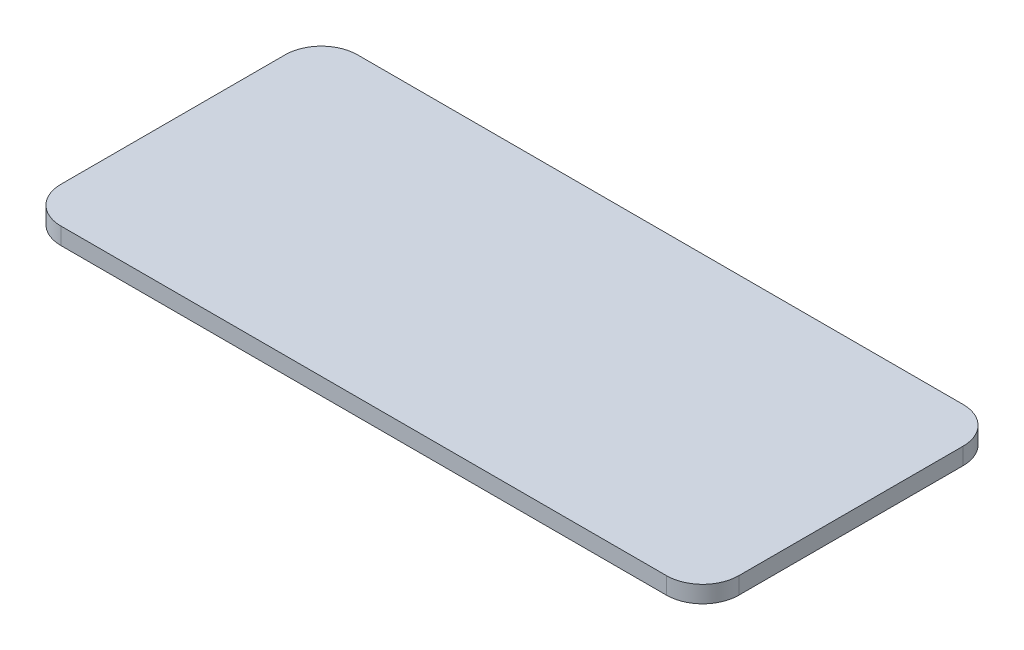
ISO-10303-21;
HEADER;
FILE_DESCRIPTION(('STEP AP214'),'2;1');
FILE_NAME('part.step','',(''),(''),'','','');
FILE_SCHEMA(('AUTOMOTIVE_DESIGN { 1 0 10303 214 1 1 1 1 }'));
ENDSEC;
DATA;
#1=APPLICATION_CONTEXT('core data for automotive mechanical design processes');
#2=APPLICATION_PROTOCOL_DEFINITION('international standard','automotive_design',2000,#1);
#3=PRODUCT_CONTEXT('',#1,'mechanical');
#4=PRODUCT('Part','Part','',(#3));
#5=PRODUCT_RELATED_PRODUCT_CATEGORY('part','',(#4));
#6=PRODUCT_DEFINITION_FORMATION('','',#4);
#7=PRODUCT_DEFINITION_CONTEXT('part definition',#1,'design');
#8=PRODUCT_DEFINITION('design','',#6,#7);
#9=PRODUCT_DEFINITION_SHAPE('','',#8);
#10=(LENGTH_UNIT() NAMED_UNIT(*) SI_UNIT(.MILLI.,.METRE.));
#11=(NAMED_UNIT(*) PLANE_ANGLE_UNIT() SI_UNIT($,.RADIAN.));
#12=(NAMED_UNIT(*) SI_UNIT($,.STERADIAN.) SOLID_ANGLE_UNIT());
#13=UNCERTAINTY_MEASURE_WITH_UNIT(LENGTH_MEASURE(1.E-05),#10,'distance_accuracy_value','');
#14=(GEOMETRIC_REPRESENTATION_CONTEXT(3) GLOBAL_UNCERTAINTY_ASSIGNED_CONTEXT((#13)) GLOBAL_UNIT_ASSIGNED_CONTEXT((#10,
#11,#12)) REPRESENTATION_CONTEXT('',''));
#15=CARTESIAN_POINT('',(0.,0.,0.));
#16=DIRECTION('',(0.,0.,1.));
#17=DIRECTION('',(1.,0.,0.));
#18=AXIS2_PLACEMENT_3D('',#15,#16,#17);
#19=CARTESIAN_POINT('',(-32.,1.59999999999999,-14.));
#20=DIRECTION('',(1.,0.,0.));
#21=DIRECTION('',(0.,0.,-1.));
#22=AXIS2_PLACEMENT_3D('',#19,#20,#21);
#23=PLANE('',#22);
#24=DIRECTION('',(0.,0.,1.));
#25=VECTOR('',#24,1.);
#26=CARTESIAN_POINT('',(-32.,1.59999999999999,-14.));
#27=LINE('',#26,#25);
#28=CARTESIAN_POINT('',(-32.,1.59999999999999,-10.59));
#29=VERTEX_POINT('',#28);
#30=CARTESIAN_POINT('',(-32.,1.59999999999999,10.59));
#31=VERTEX_POINT('',#30);
#32=EDGE_CURVE('E126',#29,#31,#27,.T.);
#33=ORIENTED_EDGE('',*,*,#32,.F.);
#34=DIRECTION('',(0.,-1.,0.));
#35=VECTOR('',#34,1.);
#36=CARTESIAN_POINT('',(-32.,1.59999999999999,-10.59));
#37=LINE('',#36,#35);
#38=CARTESIAN_POINT('',(-32.,0.,-10.59));
#39=VERTEX_POINT('',#38);
#40=EDGE_CURVE('E110',#29,#39,#37,.T.);
#41=ORIENTED_EDGE('',*,*,#40,.T.);
#42=DIRECTION('',(0.,0.,1.));
#43=VECTOR('',#42,1.);
#44=CARTESIAN_POINT('',(-32.,0.,-14.));
#45=LINE('',#44,#43);
#46=CARTESIAN_POINT('',(-32.,0.,10.59));
#47=VERTEX_POINT('',#46);
#48=EDGE_CURVE('E123',#39,#47,#45,.T.);
#49=ORIENTED_EDGE('',*,*,#48,.T.);
#50=DIRECTION('',(0.,-1.,0.));
#51=VECTOR('',#50,1.);
#52=CARTESIAN_POINT('',(-32.,1.59999999999999,10.59));
#53=LINE('',#52,#51);
#54=EDGE_CURVE('E129',#47,#31,#53,.F.);
#55=ORIENTED_EDGE('',*,*,#54,.T.);
#56=EDGE_LOOP('',(#33,#41,#49,#55));
#57=FACE_BOUND('',#56,.T.);
#58=ADVANCED_FACE('F38',(#57),#23,.F.);
#59=CARTESIAN_POINT('',(32.,1.59999999999999,14.));
#60=DIRECTION('',(0.,0.,-1.));
#61=DIRECTION('',(-1.,0.,0.));
#62=AXIS2_PLACEMENT_3D('',#59,#60,#61);
#63=PLANE('',#62);
#64=DIRECTION('',(1.,0.,0.));
#65=VECTOR('',#64,1.);
#66=CARTESIAN_POINT('',(32.,1.59999999999999,14.));
#67=LINE('',#66,#65);
#68=CARTESIAN_POINT('',(-28.59,1.59999999999999,14.));
#69=VERTEX_POINT('',#68);
#70=CARTESIAN_POINT('',(28.59,1.59999999999999,14.));
#71=VERTEX_POINT('',#70);
#72=EDGE_CURVE('E186',#69,#71,#67,.T.);
#73=ORIENTED_EDGE('',*,*,#72,.F.);
#74=DIRECTION('',(0.,-1.,0.));
#75=VECTOR('',#74,1.);
#76=CARTESIAN_POINT('',(-28.59,1.59999999999999,14.));
#77=LINE('',#76,#75);
#78=CARTESIAN_POINT('',(-28.59,0.,14.));
#79=VERTEX_POINT('',#78);
#80=EDGE_CURVE('E11',#69,#79,#77,.T.);
#81=ORIENTED_EDGE('',*,*,#80,.T.);
#82=DIRECTION('',(1.,0.,0.));
#83=VECTOR('',#82,1.);
#84=CARTESIAN_POINT('',(32.,0.,14.));
#85=LINE('',#84,#83);
#86=CARTESIAN_POINT('',(28.59,0.,14.));
#87=VERTEX_POINT('',#86);
#88=EDGE_CURVE('E135',#79,#87,#85,.T.);
#89=ORIENTED_EDGE('',*,*,#88,.T.);
#90=DIRECTION('',(0.,-1.,0.));
#91=VECTOR('',#90,1.);
#92=CARTESIAN_POINT('',(28.59,1.59999999999999,14.));
#93=LINE('',#92,#91);
#94=EDGE_CURVE('E47',#87,#71,#93,.F.);
#95=ORIENTED_EDGE('',*,*,#94,.T.);
#96=EDGE_LOOP('',(#73,#81,#89,#95));
#97=FACE_BOUND('',#96,.T.);
#98=ADVANCED_FACE('F185',(#97),#63,.F.);
#99=CARTESIAN_POINT('',(32.,1.59999999999999,-14.));
#100=DIRECTION('',(-1.,0.,0.));
#101=DIRECTION('',(0.,0.,1.));
#102=AXIS2_PLACEMENT_3D('',#99,#100,#101);
#103=PLANE('',#102);
#104=DIRECTION('',(0.,0.,-1.));
#105=VECTOR('',#104,1.);
#106=CARTESIAN_POINT('',(32.,0.,-14.));
#107=LINE('',#106,#105);
#108=CARTESIAN_POINT('',(32.,0.,10.59));
#109=VERTEX_POINT('',#108);
#110=CARTESIAN_POINT('',(32.,0.,-10.59));
#111=VERTEX_POINT('',#110);
#112=EDGE_CURVE('E140',#109,#111,#107,.T.);
#113=ORIENTED_EDGE('',*,*,#112,.T.);
#114=DIRECTION('',(0.,-1.,0.));
#115=VECTOR('',#114,1.);
#116=CARTESIAN_POINT('',(32.,1.59999999999999,-10.59));
#117=LINE('',#116,#115);
#118=CARTESIAN_POINT('',(32.,1.59999999999999,-10.59));
#119=VERTEX_POINT('',#118);
#120=EDGE_CURVE('E54',#111,#119,#117,.F.);
#121=ORIENTED_EDGE('',*,*,#120,.T.);
#122=DIRECTION('',(0.,0.,-1.));
#123=VECTOR('',#122,1.);
#124=CARTESIAN_POINT('',(32.,1.59999999999999,-14.));
#125=LINE('',#124,#123);
#126=CARTESIAN_POINT('',(32.,1.59999999999999,10.59));
#127=VERTEX_POINT('',#126);
#128=EDGE_CURVE('E193',#127,#119,#125,.T.);
#129=ORIENTED_EDGE('',*,*,#128,.F.);
#130=DIRECTION('',(0.,-1.,0.));
#131=VECTOR('',#130,1.);
#132=CARTESIAN_POINT('',(32.,1.59999999999999,10.59));
#133=LINE('',#132,#131);
#134=EDGE_CURVE('E175',#127,#109,#133,.T.);
#135=ORIENTED_EDGE('',*,*,#134,.T.);
#136=EDGE_LOOP('',(#113,#121,#129,#135));
#137=FACE_BOUND('',#136,.T.);
#138=ADVANCED_FACE('F197',(#137),#103,.F.);
#139=CARTESIAN_POINT('',(32.,1.59999999999999,-14.));
#140=DIRECTION('',(0.,0.,1.));
#141=DIRECTION('',(1.,0.,0.));
#142=AXIS2_PLACEMENT_3D('',#139,#140,#141);
#143=PLANE('',#142);
#144=DIRECTION('',(-1.,0.,0.));
#145=VECTOR('',#144,1.);
#146=CARTESIAN_POINT('',(32.,0.,-14.));
#147=LINE('',#146,#145);
#148=CARTESIAN_POINT('',(28.59,0.,-14.));
#149=VERTEX_POINT('',#148);
#150=CARTESIAN_POINT('',(-28.59,0.,-14.));
#151=VERTEX_POINT('',#150);
#152=EDGE_CURVE('E148',#149,#151,#147,.T.);
#153=ORIENTED_EDGE('',*,*,#152,.T.);
#154=DIRECTION('',(0.,-1.,0.));
#155=VECTOR('',#154,1.);
#156=CARTESIAN_POINT('',(-28.59,1.59999999999999,-14.));
#157=LINE('',#156,#155);
#158=CARTESIAN_POINT('',(-28.59,1.59999999999999,-14.));
#159=VERTEX_POINT('',#158);
#160=EDGE_CURVE('E111',#151,#159,#157,.F.);
#161=ORIENTED_EDGE('',*,*,#160,.T.);
#162=DIRECTION('',(-1.,0.,0.));
#163=VECTOR('',#162,1.);
#164=CARTESIAN_POINT('',(32.,1.59999999999999,-14.));
#165=LINE('',#164,#163);
#166=CARTESIAN_POINT('',(28.59,1.59999999999999,-14.));
#167=VERTEX_POINT('',#166);
#168=EDGE_CURVE('E143',#167,#159,#165,.T.);
#169=ORIENTED_EDGE('',*,*,#168,.F.);
#170=DIRECTION('',(0.,-1.,0.));
#171=VECTOR('',#170,1.);
#172=CARTESIAN_POINT('',(28.59,1.59999999999999,-14.));
#173=LINE('',#172,#171);
#174=EDGE_CURVE('E117',#167,#149,#173,.T.);
#175=ORIENTED_EDGE('',*,*,#174,.T.);
#176=EDGE_LOOP('',(#153,#161,#169,#175));
#177=FACE_BOUND('',#176,.T.);
#178=ADVANCED_FACE('F204',(#177),#143,.F.);
#179=CARTESIAN_POINT('',(0.,1.59999999999999,0.));
#180=DIRECTION('',(0.,-1.,0.));
#181=DIRECTION('',(0.,0.,-1.));
#182=AXIS2_PLACEMENT_3D('',#179,#180,#181);
#183=PLANE('',#182);
#184=ORIENTED_EDGE('',*,*,#168,.T.);
#185=CARTESIAN_POINT('',(-28.59,1.59999999999999,-10.59));
#186=DIRECTION('',(0.,-1.,0.));
#187=DIRECTION('',(0.,0.,-1.));
#188=AXIS2_PLACEMENT_3D('',#185,#186,#187);
#189=CIRCLE('',#188,3.41);
#190=EDGE_CURVE('E172',#159,#29,#189,.F.);
#191=ORIENTED_EDGE('',*,*,#190,.T.);
#192=ORIENTED_EDGE('',*,*,#32,.T.);
#193=CARTESIAN_POINT('',(-28.59,1.59999999999999,10.59));
#194=DIRECTION('',(0.,-1.,0.));
#195=DIRECTION('',(0.,0.,-1.));
#196=AXIS2_PLACEMENT_3D('',#193,#194,#195);
#197=CIRCLE('',#196,3.41);
#198=EDGE_CURVE('E166',#31,#69,#197,.F.);
#199=ORIENTED_EDGE('',*,*,#198,.T.);
#200=ORIENTED_EDGE('',*,*,#72,.T.);
#201=CARTESIAN_POINT('',(28.59,1.59999999999999,10.59));
#202=DIRECTION('',(0.,-1.,0.));
#203=DIRECTION('',(0.,0.,-1.));
#204=AXIS2_PLACEMENT_3D('',#201,#202,#203);
#205=CIRCLE('',#204,3.41);
#206=EDGE_CURVE('E61',#71,#127,#205,.F.);
#207=ORIENTED_EDGE('',*,*,#206,.T.);
#208=ORIENTED_EDGE('',*,*,#128,.T.);
#209=CARTESIAN_POINT('',(28.59,1.59999999999999,-10.59));
#210=DIRECTION('',(0.,-1.,0.));
#211=DIRECTION('',(0.,0.,-1.));
#212=AXIS2_PLACEMENT_3D('',#209,#210,#211);
#213=CIRCLE('',#212,3.41);
#214=EDGE_CURVE('E169',#119,#167,#213,.F.);
#215=ORIENTED_EDGE('',*,*,#214,.T.);
#216=EDGE_LOOP('',(#184,#191,#192,#199,#200,#207,#208,#215));
#217=FACE_BOUND('',#216,.T.);
#218=ADVANCED_FACE('F190',(#217),#183,.F.);
#219=CARTESIAN_POINT('',(0.,0.,0.));
#220=DIRECTION('',(0.,-1.,0.));
#221=DIRECTION('',(0.,0.,-1.));
#222=AXIS2_PLACEMENT_3D('',#219,#220,#221);
#223=PLANE('',#222);
#224=ORIENTED_EDGE('',*,*,#48,.F.);
#225=CARTESIAN_POINT('',(-28.59,0.,-10.59));
#226=DIRECTION('',(0.,-1.,0.));
#227=DIRECTION('',(0.,0.,-1.));
#228=AXIS2_PLACEMENT_3D('',#225,#226,#227);
#229=CIRCLE('',#228,3.41);
#230=EDGE_CURVE('E106',#39,#151,#229,.T.);
#231=ORIENTED_EDGE('',*,*,#230,.T.);
#232=ORIENTED_EDGE('',*,*,#152,.F.);
#233=CARTESIAN_POINT('',(28.59,0.,-10.59));
#234=DIRECTION('',(0.,-1.,0.));
#235=DIRECTION('',(0.,0.,-1.));
#236=AXIS2_PLACEMENT_3D('',#233,#234,#235);
#237=CIRCLE('',#236,3.41);
#238=EDGE_CURVE('E118',#149,#111,#237,.T.);
#239=ORIENTED_EDGE('',*,*,#238,.T.);
#240=ORIENTED_EDGE('',*,*,#112,.F.);
#241=CARTESIAN_POINT('',(28.59,0.,10.59));
#242=DIRECTION('',(0.,-1.,0.));
#243=DIRECTION('',(0.,0.,-1.));
#244=AXIS2_PLACEMENT_3D('',#241,#242,#243);
#245=CIRCLE('',#244,3.41);
#246=EDGE_CURVE('E128',#109,#87,#245,.T.);
#247=ORIENTED_EDGE('',*,*,#246,.T.);
#248=ORIENTED_EDGE('',*,*,#88,.F.);
#249=CARTESIAN_POINT('',(-28.59,0.,10.59));
#250=DIRECTION('',(0.,-1.,0.));
#251=DIRECTION('',(0.,0.,-1.));
#252=AXIS2_PLACEMENT_3D('',#249,#250,#251);
#253=CIRCLE('',#252,3.41);
#254=EDGE_CURVE('E133',#79,#47,#253,.T.);
#255=ORIENTED_EDGE('',*,*,#254,.T.);
#256=EDGE_LOOP('',(#224,#231,#232,#239,#240,#247,#248,#255));
#257=FACE_BOUND('',#256,.T.);
#258=ADVANCED_FACE('F131',(#257),#223,.T.);
#259=CARTESIAN_POINT('',(-28.59,1.59999999999999,-10.59));
#260=DIRECTION('',(0.,-1.,0.));
#261=DIRECTION('',(0.,0.,-1.));
#262=AXIS2_PLACEMENT_3D('',#259,#260,#261);
#263=CYLINDRICAL_SURFACE('',#262,3.41);
#264=ORIENTED_EDGE('',*,*,#190,.F.);
#265=ORIENTED_EDGE('',*,*,#160,.F.);
#266=ORIENTED_EDGE('',*,*,#230,.F.);
#267=ORIENTED_EDGE('',*,*,#40,.F.);
#268=EDGE_LOOP('',(#264,#265,#266,#267));
#269=FACE_BOUND('',#268,.T.);
#270=ADVANCED_FACE('F109',(#269),#263,.T.);
#271=CARTESIAN_POINT('',(28.59,1.59999999999999,-10.59));
#272=DIRECTION('',(0.,-1.,0.));
#273=DIRECTION('',(0.,0.,-1.));
#274=AXIS2_PLACEMENT_3D('',#271,#272,#273);
#275=CYLINDRICAL_SURFACE('',#274,3.41);
#276=ORIENTED_EDGE('',*,*,#214,.F.);
#277=ORIENTED_EDGE('',*,*,#120,.F.);
#278=ORIENTED_EDGE('',*,*,#238,.F.);
#279=ORIENTED_EDGE('',*,*,#174,.F.);
#280=EDGE_LOOP('',(#276,#277,#278,#279));
#281=FACE_BOUND('',#280,.T.);
#282=ADVANCED_FACE('F201',(#281),#275,.T.);
#283=CARTESIAN_POINT('',(-28.59,1.59999999999999,10.59));
#284=DIRECTION('',(0.,-1.,0.));
#285=DIRECTION('',(0.,0.,-1.));
#286=AXIS2_PLACEMENT_3D('',#283,#284,#285);
#287=CYLINDRICAL_SURFACE('',#286,3.41);
#288=ORIENTED_EDGE('',*,*,#198,.F.);
#289=ORIENTED_EDGE('',*,*,#54,.F.);
#290=ORIENTED_EDGE('',*,*,#254,.F.);
#291=ORIENTED_EDGE('',*,*,#80,.F.);
#292=EDGE_LOOP('',(#288,#289,#290,#291));
#293=FACE_BOUND('',#292,.T.);
#294=ADVANCED_FACE('F213',(#293),#287,.T.);
#295=CARTESIAN_POINT('',(28.59,1.59999999999999,10.59));
#296=DIRECTION('',(0.,-1.,0.));
#297=DIRECTION('',(0.,0.,-1.));
#298=AXIS2_PLACEMENT_3D('',#295,#296,#297);
#299=CYLINDRICAL_SURFACE('',#298,3.41);
#300=ORIENTED_EDGE('',*,*,#206,.F.);
#301=ORIENTED_EDGE('',*,*,#94,.F.);
#302=ORIENTED_EDGE('',*,*,#246,.F.);
#303=ORIENTED_EDGE('',*,*,#134,.F.);
#304=EDGE_LOOP('',(#300,#301,#302,#303));
#305=FACE_BOUND('',#304,.T.);
#306=ADVANCED_FACE('F40',(#305),#299,.T.);
#307=CLOSED_SHELL('',(#58,#98,#138,#178,#218,#258,#270,#282,#294,#306));
#308=MANIFOLD_SOLID_BREP('B2',#307);
#309=ADVANCED_BREP_SHAPE_REPRESENTATION('',(#18,#308),#14);
#310=SHAPE_DEFINITION_REPRESENTATION(#9,#309);
ENDSEC;
END-ISO-10303-21;
